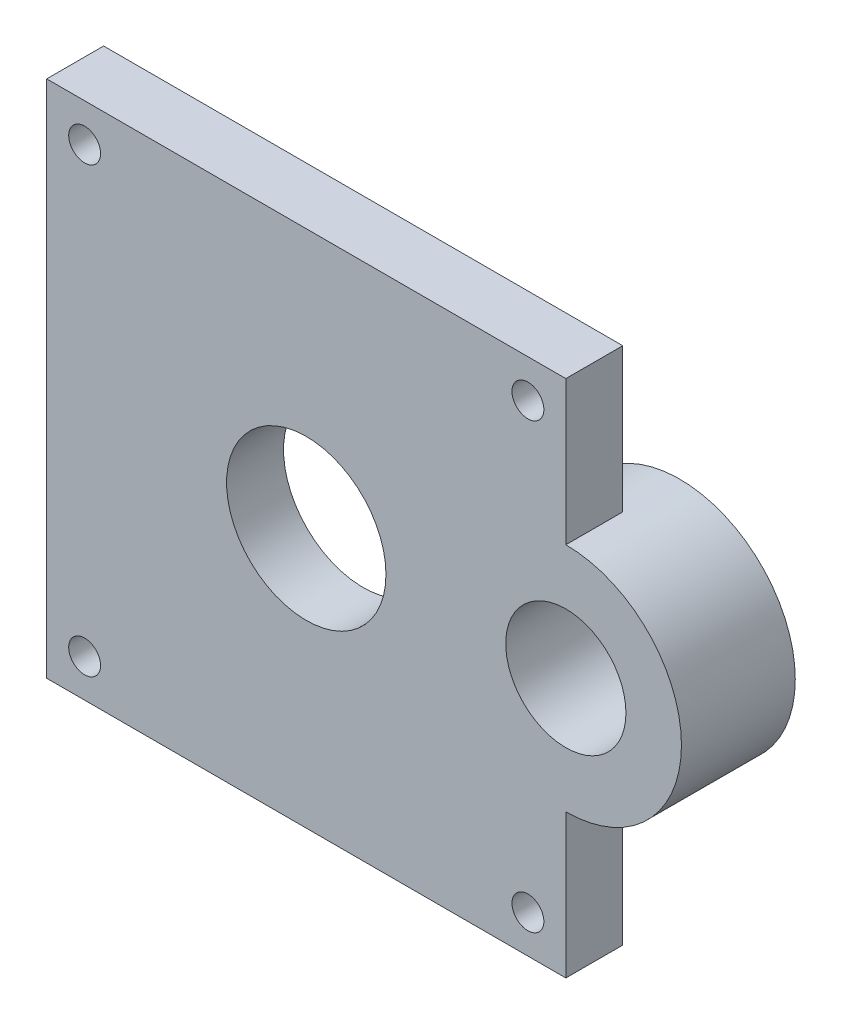
ISO-10303-21;
HEADER;
FILE_DESCRIPTION(('STEP AP214'),'2;1');
FILE_NAME('part.step','',(''),(''),'','','');
FILE_SCHEMA(('AUTOMOTIVE_DESIGN { 1 0 10303 214 1 1 1 1 }'));
ENDSEC;
DATA;
#1=APPLICATION_CONTEXT('core data for automotive mechanical design processes');
#2=APPLICATION_PROTOCOL_DEFINITION('international standard','automotive_design',2000,#1);
#3=PRODUCT_CONTEXT('',#1,'mechanical');
#4=PRODUCT('Part','Part','',(#3));
#5=PRODUCT_RELATED_PRODUCT_CATEGORY('part','',(#4));
#6=PRODUCT_DEFINITION_FORMATION('','',#4);
#7=PRODUCT_DEFINITION_CONTEXT('part definition',#1,'design');
#8=PRODUCT_DEFINITION('design','',#6,#7);
#9=PRODUCT_DEFINITION_SHAPE('','',#8);
#10=(LENGTH_UNIT() NAMED_UNIT(*) SI_UNIT(.MILLI.,.METRE.));
#11=(NAMED_UNIT(*) PLANE_ANGLE_UNIT() SI_UNIT($,.RADIAN.));
#12=(NAMED_UNIT(*) SI_UNIT($,.STERADIAN.) SOLID_ANGLE_UNIT());
#13=UNCERTAINTY_MEASURE_WITH_UNIT(LENGTH_MEASURE(1.E-05),#10,'distance_accuracy_value','');
#14=(GEOMETRIC_REPRESENTATION_CONTEXT(3) GLOBAL_UNCERTAINTY_ASSIGNED_CONTEXT((#13)) GLOBAL_UNIT_ASSIGNED_CONTEXT((#10,
#11,#12)) REPRESENTATION_CONTEXT('',''));
#15=CARTESIAN_POINT('',(0.,0.,0.));
#16=DIRECTION('',(0.,0.,1.));
#17=DIRECTION('',(1.,0.,0.));
#18=AXIS2_PLACEMENT_3D('',#15,#16,#17);
#19=CARTESIAN_POINT('',(28.956,0.,3.175));
#20=DIRECTION('',(-1.,0.,0.));
#21=DIRECTION('',(0.,0.,1.));
#22=AXIS2_PLACEMENT_3D('',#19,#20,#21);
#23=PLANE('',#22);
#24=DIRECTION('',(0.,1.,0.));
#25=VECTOR('',#24,1.);
#26=CARTESIAN_POINT('',(28.956,0.,0.));
#27=LINE('',#26,#25);
#28=CARTESIAN_POINT('',(28.956,0.,0.));
#29=VERTEX_POINT('',#28);
#30=CARTESIAN_POINT('',(28.956,8.02878125,0.));
#31=VERTEX_POINT('',#30);
#32=EDGE_CURVE('E114',#29,#31,#27,.T.);
#33=ORIENTED_EDGE('',*,*,#32,.T.);
#34=DIRECTION('',(0.,0.,1.));
#35=VECTOR('',#34,1.);
#36=CARTESIAN_POINT('',(28.956,8.02878125,-3.175));
#37=LINE('',#36,#35);
#38=CARTESIAN_POINT('',(28.956,8.02878125,3.175));
#39=VERTEX_POINT('',#38);
#40=EDGE_CURVE('E11',#31,#39,#37,.T.);
#41=ORIENTED_EDGE('',*,*,#40,.T.);
#42=DIRECTION('',(0.,1.,0.));
#43=VECTOR('',#42,1.);
#44=CARTESIAN_POINT('',(28.956,0.,3.175));
#45=LINE('',#44,#43);
#46=CARTESIAN_POINT('',(28.956,0.,3.175));
#47=VERTEX_POINT('',#46);
#48=EDGE_CURVE('E112',#47,#39,#45,.T.);
#49=ORIENTED_EDGE('',*,*,#48,.F.);
#50=DIRECTION('',(0.,0.,-1.));
#51=VECTOR('',#50,1.);
#52=CARTESIAN_POINT('',(28.956,0.,3.175));
#53=LINE('',#52,#51);
#54=EDGE_CURVE('E146',#47,#29,#53,.T.);
#55=ORIENTED_EDGE('',*,*,#54,.T.);
#56=EDGE_LOOP('',(#33,#41,#49,#55));
#57=FACE_BOUND('',#56,.T.);
#58=ADVANCED_FACE('F39',(#57),#23,.F.);
#59=CARTESIAN_POINT('',(0.,0.,3.175));
#60=DIRECTION('',(0.,0.,-1.));
#61=DIRECTION('',(-1.,0.,0.));
#62=AXIS2_PLACEMENT_3D('',#59,#60,#61);
#63=PLANE('',#62);
#64=CARTESIAN_POINT('',(28.956,14.478,3.175));
#65=DIRECTION('',(0.,0.,1.));
#66=DIRECTION('',(1.,0.,0.));
#67=AXIS2_PLACEMENT_3D('',#64,#65,#66);
#68=CIRCLE('',#67,3.3528);
#69=CARTESIAN_POINT('',(32.3088,14.478,3.175));
#70=VERTEX_POINT('',#69);
#71=EDGE_CURVE('E209',#70,#70,#68,.T.);
#72=ORIENTED_EDGE('',*,*,#71,.F.);
#73=EDGE_LOOP('',(#72));
#74=FACE_BOUND('',#73,.T.);
#75=CARTESIAN_POINT('',(2.11455,26.84145,3.175));
#76=DIRECTION('',(0.,0.,1.));
#77=DIRECTION('',(-1.,0.,0.));
#78=AXIS2_PLACEMENT_3D('',#75,#76,#77);
#79=CIRCLE('',#78,0.888999999999999);
#80=CARTESIAN_POINT('',(1.22555,26.84145,3.175));
#81=VERTEX_POINT('',#80);
#82=EDGE_CURVE('E197',#81,#81,#79,.T.);
#83=ORIENTED_EDGE('',*,*,#82,.F.);
#84=EDGE_LOOP('',(#83));
#85=FACE_BOUND('',#84,.T.);
#86=CARTESIAN_POINT('',(26.84145,26.84145,3.175));
#87=DIRECTION('',(0.,0.,1.));
#88=DIRECTION('',(1.,0.,0.));
#89=AXIS2_PLACEMENT_3D('',#86,#87,#88);
#90=CIRCLE('',#89,0.889000000000002);
#91=CARTESIAN_POINT('',(27.73045,26.84145,3.175));
#92=VERTEX_POINT('',#91);
#93=EDGE_CURVE('E189',#92,#92,#90,.T.);
#94=ORIENTED_EDGE('',*,*,#93,.F.);
#95=EDGE_LOOP('',(#94));
#96=FACE_BOUND('',#95,.T.);
#97=CARTESIAN_POINT('',(26.84145,2.11455,3.175));
#98=DIRECTION('',(0.,0.,1.));
#99=DIRECTION('',(-1.,0.,0.));
#100=AXIS2_PLACEMENT_3D('',#97,#98,#99);
#101=CIRCLE('',#100,0.889000000000003);
#102=CARTESIAN_POINT('',(25.95245,2.11455,3.175));
#103=VERTEX_POINT('',#102);
#104=EDGE_CURVE('E181',#103,#103,#101,.T.);
#105=ORIENTED_EDGE('',*,*,#104,.F.);
#106=EDGE_LOOP('',(#105));
#107=FACE_BOUND('',#106,.T.);
#108=CARTESIAN_POINT('',(2.11455,2.11455,3.175));
#109=DIRECTION('',(0.,0.,1.));
#110=DIRECTION('',(1.,0.,0.));
#111=AXIS2_PLACEMENT_3D('',#108,#109,#110);
#112=CIRCLE('',#111,0.889);
#113=CARTESIAN_POINT('',(3.00355,2.11455,3.175));
#114=VERTEX_POINT('',#113);
#115=EDGE_CURVE('E173',#114,#114,#112,.T.);
#116=ORIENTED_EDGE('',*,*,#115,.F.);
#117=EDGE_LOOP('',(#116));
#118=FACE_BOUND('',#117,.T.);
#119=ORIENTED_EDGE('',*,*,#48,.T.);
#120=CARTESIAN_POINT('',(28.956,14.478,3.175));
#121=DIRECTION('',(0.,0.,1.));
#122=DIRECTION('',(1.,0.,0.));
#123=AXIS2_PLACEMENT_3D('',#120,#121,#122);
#124=CIRCLE('',#123,6.44921875);
#125=CARTESIAN_POINT('',(28.956,20.92721875,3.175));
#126=VERTEX_POINT('',#125);
#127=EDGE_CURVE('E55',#39,#126,#124,.T.);
#128=ORIENTED_EDGE('',*,*,#127,.T.);
#129=CARTESIAN_POINT('',(28.956,28.956,3.175));
#130=VERTEX_POINT('',#129);
#131=EDGE_CURVE('E118',#126,#130,#45,.T.);
#132=ORIENTED_EDGE('',*,*,#131,.T.);
#133=DIRECTION('',(-1.,0.,0.));
#134=VECTOR('',#133,1.);
#135=CARTESIAN_POINT('',(0.,28.956,3.175));
#136=LINE('',#135,#134);
#137=CARTESIAN_POINT('',(0.,28.956,3.175));
#138=VERTEX_POINT('',#137);
#139=EDGE_CURVE('E62',#130,#138,#136,.T.);
#140=ORIENTED_EDGE('',*,*,#139,.T.);
#141=DIRECTION('',(0.,-1.,0.));
#142=VECTOR('',#141,1.);
#143=CARTESIAN_POINT('',(0.,0.,3.175));
#144=LINE('',#143,#142);
#145=CARTESIAN_POINT('',(0.,0.,3.175));
#146=VERTEX_POINT('',#145);
#147=EDGE_CURVE('E140',#138,#146,#144,.T.);
#148=ORIENTED_EDGE('',*,*,#147,.T.);
#149=DIRECTION('',(1.,0.,0.));
#150=VECTOR('',#149,1.);
#151=CARTESIAN_POINT('',(0.,0.,3.175));
#152=LINE('',#151,#150);
#153=EDGE_CURVE('E91',#146,#47,#152,.T.);
#154=ORIENTED_EDGE('',*,*,#153,.T.);
#155=EDGE_LOOP('',(#119,#128,#132,#140,#148,#154));
#156=FACE_BOUND('',#155,.T.);
#157=CARTESIAN_POINT('',(14.478,14.478,3.175));
#158=DIRECTION('',(0.,0.,1.));
#159=DIRECTION('',(1.,0.,0.));
#160=AXIS2_PLACEMENT_3D('',#157,#158,#159);
#161=CIRCLE('',#160,4.445);
#162=CARTESIAN_POINT('',(18.923,14.478,3.175));
#163=VERTEX_POINT('',#162);
#164=EDGE_CURVE('E132',#163,#163,#161,.T.);
#165=ORIENTED_EDGE('',*,*,#164,.F.);
#166=EDGE_LOOP('',(#165));
#167=FACE_BOUND('',#166,.T.);
#168=ADVANCED_FACE('F115',(#74,#85,#96,#107,#118,#156,#167),#63,.F.);
#169=CARTESIAN_POINT('',(0.,0.,0.));
#170=DIRECTION('',(0.,0.,-1.));
#171=DIRECTION('',(-1.,0.,0.));
#172=AXIS2_PLACEMENT_3D('',#169,#170,#171);
#173=PLANE('',#172);
#174=CARTESIAN_POINT('',(28.956,14.478,0.));
#175=DIRECTION('',(0.,0.,-1.));
#176=DIRECTION('',(-1.,0.,0.));
#177=AXIS2_PLACEMENT_3D('',#174,#175,#176);
#178=CIRCLE('',#177,6.44921875);
#179=CARTESIAN_POINT('',(28.956,20.92721875,0.));
#180=VERTEX_POINT('',#179);
#181=EDGE_CURVE('E159',#31,#180,#178,.T.);
#182=ORIENTED_EDGE('',*,*,#181,.F.);
#183=ORIENTED_EDGE('',*,*,#32,.F.);
#184=DIRECTION('',(1.,0.,0.));
#185=VECTOR('',#184,1.);
#186=CARTESIAN_POINT('',(0.,0.,0.));
#187=LINE('',#186,#185);
#188=CARTESIAN_POINT('',(0.,0.,0.));
#189=VERTEX_POINT('',#188);
#190=EDGE_CURVE('E131',#189,#29,#187,.T.);
#191=ORIENTED_EDGE('',*,*,#190,.F.);
#192=DIRECTION('',(0.,-1.,0.));
#193=VECTOR('',#192,1.);
#194=CARTESIAN_POINT('',(0.,0.,0.));
#195=LINE('',#194,#193);
#196=CARTESIAN_POINT('',(0.,28.956,0.));
#197=VERTEX_POINT('',#196);
#198=EDGE_CURVE('E127',#197,#189,#195,.T.);
#199=ORIENTED_EDGE('',*,*,#198,.F.);
#200=DIRECTION('',(-1.,0.,0.));
#201=VECTOR('',#200,1.);
#202=CARTESIAN_POINT('',(0.,28.956,0.));
#203=LINE('',#202,#201);
#204=CARTESIAN_POINT('',(28.956,28.956,0.));
#205=VERTEX_POINT('',#204);
#206=EDGE_CURVE('E83',#205,#197,#203,.T.);
#207=ORIENTED_EDGE('',*,*,#206,.F.);
#208=EDGE_CURVE('E135',#180,#205,#27,.T.);
#209=ORIENTED_EDGE('',*,*,#208,.F.);
#210=EDGE_LOOP('',(#182,#183,#191,#199,#207,#209));
#211=FACE_BOUND('',#210,.T.);
#212=CARTESIAN_POINT('',(2.11455,26.84145,0.));
#213=DIRECTION('',(0.,0.,1.));
#214=DIRECTION('',(-1.,0.,0.));
#215=AXIS2_PLACEMENT_3D('',#212,#213,#214);
#216=CIRCLE('',#215,0.888999999999999);
#217=CARTESIAN_POINT('',(1.22555,26.84145,0.));
#218=VERTEX_POINT('',#217);
#219=EDGE_CURVE('E193',#218,#218,#216,.T.);
#220=ORIENTED_EDGE('',*,*,#219,.T.);
#221=EDGE_LOOP('',(#220));
#222=FACE_BOUND('',#221,.T.);
#223=CARTESIAN_POINT('',(26.84145,26.84145,0.));
#224=DIRECTION('',(0.,0.,1.));
#225=DIRECTION('',(1.,0.,0.));
#226=AXIS2_PLACEMENT_3D('',#223,#224,#225);
#227=CIRCLE('',#226,0.889000000000002);
#228=CARTESIAN_POINT('',(27.73045,26.84145,0.));
#229=VERTEX_POINT('',#228);
#230=EDGE_CURVE('E185',#229,#229,#227,.T.);
#231=ORIENTED_EDGE('',*,*,#230,.T.);
#232=EDGE_LOOP('',(#231));
#233=FACE_BOUND('',#232,.T.);
#234=CARTESIAN_POINT('',(26.84145,2.11455,0.));
#235=DIRECTION('',(0.,0.,1.));
#236=DIRECTION('',(-1.,0.,0.));
#237=AXIS2_PLACEMENT_3D('',#234,#235,#236);
#238=CIRCLE('',#237,0.889000000000003);
#239=CARTESIAN_POINT('',(25.95245,2.11455,0.));
#240=VERTEX_POINT('',#239);
#241=EDGE_CURVE('E177',#240,#240,#238,.T.);
#242=ORIENTED_EDGE('',*,*,#241,.T.);
#243=EDGE_LOOP('',(#242));
#244=FACE_BOUND('',#243,.T.);
#245=CARTESIAN_POINT('',(2.11455,2.11455,0.));
#246=DIRECTION('',(0.,0.,1.));
#247=DIRECTION('',(1.,0.,0.));
#248=AXIS2_PLACEMENT_3D('',#245,#246,#247);
#249=CIRCLE('',#248,0.889);
#250=CARTESIAN_POINT('',(3.00355,2.11455,0.));
#251=VERTEX_POINT('',#250);
#252=EDGE_CURVE('E169',#251,#251,#249,.T.);
#253=ORIENTED_EDGE('',*,*,#252,.T.);
#254=EDGE_LOOP('',(#253));
#255=FACE_BOUND('',#254,.T.);
#256=CARTESIAN_POINT('',(14.478,14.478,0.));
#257=DIRECTION('',(0.,0.,1.));
#258=DIRECTION('',(1.,0.,0.));
#259=AXIS2_PLACEMENT_3D('',#256,#257,#258);
#260=CIRCLE('',#259,4.445);
#261=CARTESIAN_POINT('',(18.923,14.478,0.));
#262=VERTEX_POINT('',#261);
#263=EDGE_CURVE('E165',#262,#262,#260,.T.);
#264=ORIENTED_EDGE('',*,*,#263,.T.);
#265=EDGE_LOOP('',(#264));
#266=FACE_BOUND('',#265,.T.);
#267=ADVANCED_FACE('F157',(#211,#222,#233,#244,#255,#266),#173,.T.);
#268=CARTESIAN_POINT('',(0.,0.,3.175));
#269=DIRECTION('',(1.,0.,0.));
#270=DIRECTION('',(0.,0.,-1.));
#271=AXIS2_PLACEMENT_3D('',#268,#269,#270);
#272=PLANE('',#271);
#273=ORIENTED_EDGE('',*,*,#198,.T.);
#274=DIRECTION('',(0.,0.,-1.));
#275=VECTOR('',#274,1.);
#276=CARTESIAN_POINT('',(0.,0.,3.175));
#277=LINE('',#276,#275);
#278=EDGE_CURVE('E149',#146,#189,#277,.T.);
#279=ORIENTED_EDGE('',*,*,#278,.F.);
#280=ORIENTED_EDGE('',*,*,#147,.F.);
#281=DIRECTION('',(0.,0.,-1.));
#282=VECTOR('',#281,1.);
#283=CARTESIAN_POINT('',(0.,28.956,3.175));
#284=LINE('',#283,#282);
#285=EDGE_CURVE('E122',#138,#197,#284,.T.);
#286=ORIENTED_EDGE('',*,*,#285,.T.);
#287=EDGE_LOOP('',(#273,#279,#280,#286));
#288=FACE_BOUND('',#287,.T.);
#289=ADVANCED_FACE('F41',(#288),#272,.F.);
#290=CARTESIAN_POINT('',(0.,0.,3.175));
#291=DIRECTION('',(0.,1.,0.));
#292=DIRECTION('',(0.,0.,1.));
#293=AXIS2_PLACEMENT_3D('',#290,#291,#292);
#294=PLANE('',#293);
#295=ORIENTED_EDGE('',*,*,#190,.T.);
#296=ORIENTED_EDGE('',*,*,#54,.F.);
#297=ORIENTED_EDGE('',*,*,#153,.F.);
#298=ORIENTED_EDGE('',*,*,#278,.T.);
#299=EDGE_LOOP('',(#295,#296,#297,#298));
#300=FACE_BOUND('',#299,.T.);
#301=ADVANCED_FACE('F220',(#300),#294,.F.);
#302=ORIENTED_EDGE('',*,*,#131,.F.);
#303=DIRECTION('',(0.,0.,1.));
#304=VECTOR('',#303,1.);
#305=CARTESIAN_POINT('',(28.956,20.92721875,-3.175));
#306=LINE('',#305,#304);
#307=EDGE_CURVE('E48',#126,#180,#306,.F.);
#308=ORIENTED_EDGE('',*,*,#307,.T.);
#309=ORIENTED_EDGE('',*,*,#208,.T.);
#310=DIRECTION('',(0.,0.,-1.));
#311=VECTOR('',#310,1.);
#312=CARTESIAN_POINT('',(28.956,28.956,3.175));
#313=LINE('',#312,#311);
#314=EDGE_CURVE('E143',#130,#205,#313,.T.);
#315=ORIENTED_EDGE('',*,*,#314,.F.);
#316=EDGE_LOOP('',(#302,#308,#309,#315));
#317=FACE_BOUND('',#316,.T.);
#318=ADVANCED_FACE('F154',(#317),#23,.F.);
#319=CARTESIAN_POINT('',(0.,28.956,3.175));
#320=DIRECTION('',(0.,-1.,0.));
#321=DIRECTION('',(0.,0.,-1.));
#322=AXIS2_PLACEMENT_3D('',#319,#320,#321);
#323=PLANE('',#322);
#324=ORIENTED_EDGE('',*,*,#206,.T.);
#325=ORIENTED_EDGE('',*,*,#285,.F.);
#326=ORIENTED_EDGE('',*,*,#139,.F.);
#327=ORIENTED_EDGE('',*,*,#314,.T.);
#328=EDGE_LOOP('',(#324,#325,#326,#327));
#329=FACE_BOUND('',#328,.T.);
#330=ADVANCED_FACE('F226',(#329),#323,.F.);
#331=CARTESIAN_POINT('',(14.478,14.478,3.175));
#332=DIRECTION('',(0.,0.,-1.));
#333=DIRECTION('',(-1.,0.,0.));
#334=AXIS2_PLACEMENT_3D('',#331,#332,#333);
#335=CYLINDRICAL_SURFACE('',#334,4.445);
#336=ORIENTED_EDGE('',*,*,#164,.T.);
#337=EDGE_LOOP('',(#336));
#338=FACE_BOUND('',#337,.T.);
#339=ORIENTED_EDGE('',*,*,#263,.F.);
#340=EDGE_LOOP('',(#339));
#341=FACE_BOUND('',#340,.T.);
#342=ADVANCED_FACE('F237',(#338,#341),#335,.F.);
#343=CARTESIAN_POINT('',(2.11455,2.11455,0.));
#344=DIRECTION('',(0.,0.,1.));
#345=DIRECTION('',(1.,0.,0.));
#346=AXIS2_PLACEMENT_3D('',#343,#344,#345);
#347=CYLINDRICAL_SURFACE('',#346,0.889);
#348=ORIENTED_EDGE('',*,*,#252,.F.);
#349=EDGE_LOOP('',(#348));
#350=FACE_BOUND('',#349,.T.);
#351=ORIENTED_EDGE('',*,*,#115,.T.);
#352=EDGE_LOOP('',(#351));
#353=FACE_BOUND('',#352,.T.);
#354=ADVANCED_FACE('F242',(#350,#353),#347,.F.);
#355=CARTESIAN_POINT('',(26.84145,2.11455,0.));
#356=DIRECTION('',(0.,0.,1.));
#357=DIRECTION('',(1.,0.,0.));
#358=AXIS2_PLACEMENT_3D('',#355,#356,#357);
#359=CYLINDRICAL_SURFACE('',#358,0.889000000000003);
#360=ORIENTED_EDGE('',*,*,#241,.F.);
#361=EDGE_LOOP('',(#360));
#362=FACE_BOUND('',#361,.T.);
#363=ORIENTED_EDGE('',*,*,#104,.T.);
#364=EDGE_LOOP('',(#363));
#365=FACE_BOUND('',#364,.T.);
#366=ADVANCED_FACE('F246',(#362,#365),#359,.F.);
#367=CARTESIAN_POINT('',(26.84145,26.84145,0.));
#368=DIRECTION('',(0.,0.,1.));
#369=DIRECTION('',(1.,0.,0.));
#370=AXIS2_PLACEMENT_3D('',#367,#368,#369);
#371=CYLINDRICAL_SURFACE('',#370,0.889000000000002);
#372=ORIENTED_EDGE('',*,*,#230,.F.);
#373=EDGE_LOOP('',(#372));
#374=FACE_BOUND('',#373,.T.);
#375=ORIENTED_EDGE('',*,*,#93,.T.);
#376=EDGE_LOOP('',(#375));
#377=FACE_BOUND('',#376,.T.);
#378=ADVANCED_FACE('F251',(#374,#377),#371,.F.);
#379=CARTESIAN_POINT('',(2.11455,26.84145,0.));
#380=DIRECTION('',(0.,0.,1.));
#381=DIRECTION('',(1.,0.,0.));
#382=AXIS2_PLACEMENT_3D('',#379,#380,#381);
#383=CYLINDRICAL_SURFACE('',#382,0.888999999999999);
#384=ORIENTED_EDGE('',*,*,#219,.F.);
#385=EDGE_LOOP('',(#384));
#386=FACE_BOUND('',#385,.T.);
#387=ORIENTED_EDGE('',*,*,#82,.T.);
#388=EDGE_LOOP('',(#387));
#389=FACE_BOUND('',#388,.T.);
#390=ADVANCED_FACE('F248',(#386,#389),#383,.F.);
#391=CARTESIAN_POINT('',(28.956,14.478,-3.175));
#392=DIRECTION('',(0.,0.,1.));
#393=DIRECTION('',(1.,0.,0.));
#394=AXIS2_PLACEMENT_3D('',#391,#392,#393);
#395=CYLINDRICAL_SURFACE('',#394,6.44921875);
#396=CARTESIAN_POINT('',(28.956,14.478,-3.175));
#397=DIRECTION('',(0.,0.,1.));
#398=DIRECTION('',(1.,0.,0.));
#399=AXIS2_PLACEMENT_3D('',#396,#397,#398);
#400=CIRCLE('',#399,6.44921875);
#401=CARTESIAN_POINT('',(35.40521875,14.478,-3.175));
#402=VERTEX_POINT('',#401);
#403=EDGE_CURVE('E105',#402,#402,#400,.T.);
#404=ORIENTED_EDGE('',*,*,#403,.T.);
#405=EDGE_LOOP('',(#404));
#406=FACE_BOUND('',#405,.T.);
#407=ORIENTED_EDGE('',*,*,#40,.F.);
#408=ORIENTED_EDGE('',*,*,#181,.T.);
#409=ORIENTED_EDGE('',*,*,#307,.F.);
#410=ORIENTED_EDGE('',*,*,#127,.F.);
#411=EDGE_LOOP('',(#407,#408,#409,#410));
#412=FACE_BOUND('',#411,.T.);
#413=ADVANCED_FACE('F100',(#406,#412),#395,.T.);
#414=CARTESIAN_POINT('',(28.956,14.478,-3.175));
#415=DIRECTION('',(0.,0.,1.));
#416=DIRECTION('',(1.,0.,0.));
#417=AXIS2_PLACEMENT_3D('',#414,#415,#416);
#418=PLANE('',#417);
#419=CARTESIAN_POINT('',(28.956,14.478,-3.175));
#420=DIRECTION('',(0.,0.,1.));
#421=DIRECTION('',(1.,0.,0.));
#422=AXIS2_PLACEMENT_3D('',#419,#420,#421);
#423=CIRCLE('',#422,3.3528);
#424=CARTESIAN_POINT('',(32.3088,14.478,-3.175));
#425=VERTEX_POINT('',#424);
#426=EDGE_CURVE('E106',#425,#425,#423,.T.);
#427=ORIENTED_EDGE('',*,*,#426,.T.);
#428=EDGE_LOOP('',(#427));
#429=FACE_BOUND('',#428,.T.);
#430=ORIENTED_EDGE('',*,*,#403,.F.);
#431=EDGE_LOOP('',(#430));
#432=FACE_BOUND('',#431,.T.);
#433=ADVANCED_FACE('F261',(#429,#432),#418,.F.);
#434=CARTESIAN_POINT('',(28.956,14.478,-3.175));
#435=DIRECTION('',(0.,0.,1.));
#436=DIRECTION('',(1.,0.,0.));
#437=AXIS2_PLACEMENT_3D('',#434,#435,#436);
#438=CYLINDRICAL_SURFACE('',#437,3.3528);
#439=ORIENTED_EDGE('',*,*,#426,.F.);
#440=EDGE_LOOP('',(#439));
#441=FACE_BOUND('',#440,.T.);
#442=ORIENTED_EDGE('',*,*,#71,.T.);
#443=EDGE_LOOP('',(#442));
#444=FACE_BOUND('',#443,.T.);
#445=ADVANCED_FACE('F265',(#441,#444),#438,.F.);
#446=CLOSED_SHELL('',(#58,#168,#267,#289,#301,#318,#330,#342,#354,#366,#378,#390,#413,#433,#445));
#447=MANIFOLD_SOLID_BREP('B2',#446);
#448=ADVANCED_BREP_SHAPE_REPRESENTATION('',(#18,#447),#14);
#449=SHAPE_DEFINITION_REPRESENTATION(#9,#448);
ENDSEC;
END-ISO-10303-21;
